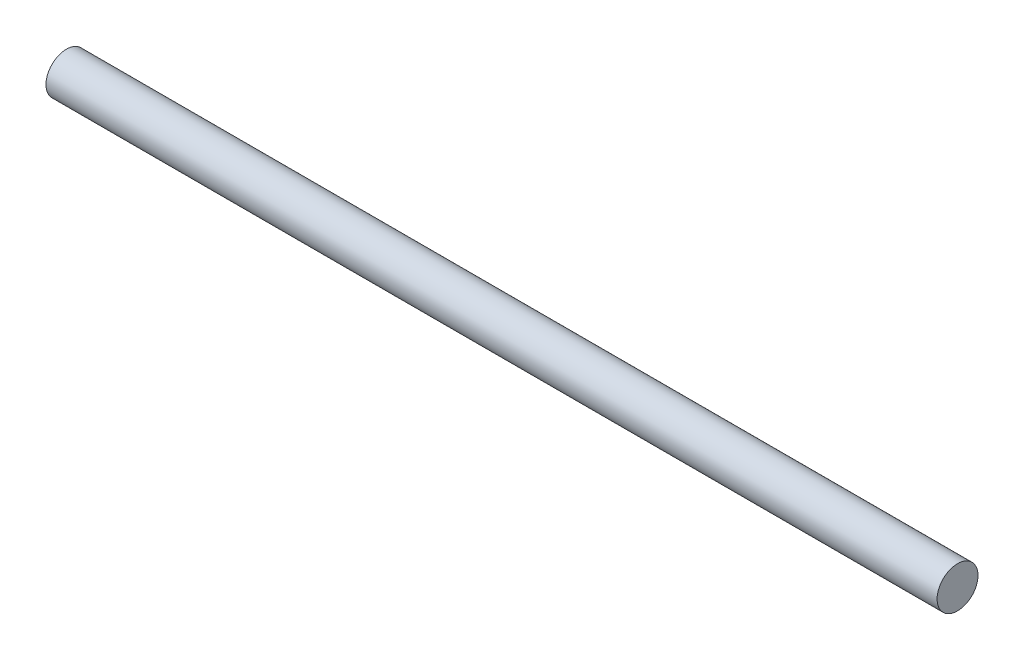
ISO-10303-21;
HEADER;
FILE_DESCRIPTION(('STEP AP214'),'2;1');
FILE_NAME('part.step','',(''),(''),'','','');
FILE_SCHEMA(('AUTOMOTIVE_DESIGN { 1 0 10303 214 1 1 1 1 }'));
ENDSEC;
DATA;
#1=APPLICATION_CONTEXT('core data for automotive mechanical design processes');
#2=APPLICATION_PROTOCOL_DEFINITION('international standard','automotive_design',2000,#1);
#3=PRODUCT_CONTEXT('',#1,'mechanical');
#4=PRODUCT('Part','Part','',(#3));
#5=PRODUCT_RELATED_PRODUCT_CATEGORY('part','',(#4));
#6=PRODUCT_DEFINITION_FORMATION('','',#4);
#7=PRODUCT_DEFINITION_CONTEXT('part definition',#1,'design');
#8=PRODUCT_DEFINITION('design','',#6,#7);
#9=PRODUCT_DEFINITION_SHAPE('','',#8);
#10=(LENGTH_UNIT() NAMED_UNIT(*) SI_UNIT(.MILLI.,.METRE.));
#11=(NAMED_UNIT(*) PLANE_ANGLE_UNIT() SI_UNIT($,.RADIAN.));
#12=(NAMED_UNIT(*) SI_UNIT($,.STERADIAN.) SOLID_ANGLE_UNIT());
#13=UNCERTAINTY_MEASURE_WITH_UNIT(LENGTH_MEASURE(1.E-05),#10,'distance_accuracy_value','');
#14=(GEOMETRIC_REPRESENTATION_CONTEXT(3) GLOBAL_UNCERTAINTY_ASSIGNED_CONTEXT((#13)) GLOBAL_UNIT_ASSIGNED_CONTEXT((#10,
#11,#12)) REPRESENTATION_CONTEXT('',''));
#15=CARTESIAN_POINT('',(0.,0.,0.));
#16=DIRECTION('',(0.,0.,1.));
#17=DIRECTION('',(1.,0.,0.));
#18=AXIS2_PLACEMENT_3D('',#15,#16,#17);
#19=CARTESIAN_POINT('',(47.9,0.,0.));
#20=DIRECTION('',(-1.,0.,0.));
#21=DIRECTION('',(0.,0.,1.));
#22=AXIS2_PLACEMENT_3D('',#19,#20,#21);
#23=CYLINDRICAL_SURFACE('',#22,2.2);
#24=CARTESIAN_POINT('',(47.9,0.,0.));
#25=DIRECTION('',(1.,0.,0.));
#26=DIRECTION('',(0.,0.,-1.));
#27=AXIS2_PLACEMENT_3D('',#24,#25,#26);
#28=CIRCLE('',#27,2.2);
#29=CARTESIAN_POINT('',(47.9,0.,-2.2));
#30=VERTEX_POINT('',#29);
#31=EDGE_CURVE('E10',#30,#30,#28,.T.);
#32=ORIENTED_EDGE('',*,*,#31,.F.);
#33=EDGE_LOOP('',(#32));
#34=FACE_BOUND('',#33,.T.);
#35=CARTESIAN_POINT('',(-47.9,0.,0.));
#36=DIRECTION('',(1.,0.,0.));
#37=DIRECTION('',(0.,0.,-1.));
#38=AXIS2_PLACEMENT_3D('',#35,#36,#37);
#39=CIRCLE('',#38,2.2);
#40=CARTESIAN_POINT('',(-47.9,0.,-2.2));
#41=VERTEX_POINT('',#40);
#42=EDGE_CURVE('E40',#41,#41,#39,.T.);
#43=ORIENTED_EDGE('',*,*,#42,.T.);
#44=EDGE_LOOP('',(#43));
#45=FACE_BOUND('',#44,.T.);
#46=ADVANCED_FACE('F37',(#34,#45),#23,.T.);
#47=CARTESIAN_POINT('',(47.9,0.,0.));
#48=DIRECTION('',(1.,0.,0.));
#49=DIRECTION('',(0.,0.,-1.));
#50=AXIS2_PLACEMENT_3D('',#47,#48,#49);
#51=PLANE('',#50);
#52=ORIENTED_EDGE('',*,*,#31,.T.);
#53=EDGE_LOOP('',(#52));
#54=FACE_BOUND('',#53,.T.);
#55=ADVANCED_FACE('F52',(#54),#51,.T.);
#56=CARTESIAN_POINT('',(-47.9,0.,0.));
#57=DIRECTION('',(1.,0.,0.));
#58=DIRECTION('',(0.,0.,-1.));
#59=AXIS2_PLACEMENT_3D('',#56,#57,#58);
#60=PLANE('',#59);
#61=ORIENTED_EDGE('',*,*,#42,.F.);
#62=EDGE_LOOP('',(#61));
#63=FACE_BOUND('',#62,.T.);
#64=ADVANCED_FACE('F50',(#63),#60,.F.);
#65=CLOSED_SHELL('',(#46,#55,#64));
#66=MANIFOLD_SOLID_BREP('B2',#65);
#67=ADVANCED_BREP_SHAPE_REPRESENTATION('',(#18,#66),#14);
#68=SHAPE_DEFINITION_REPRESENTATION(#9,#67);
ENDSEC;
END-ISO-10303-21;
